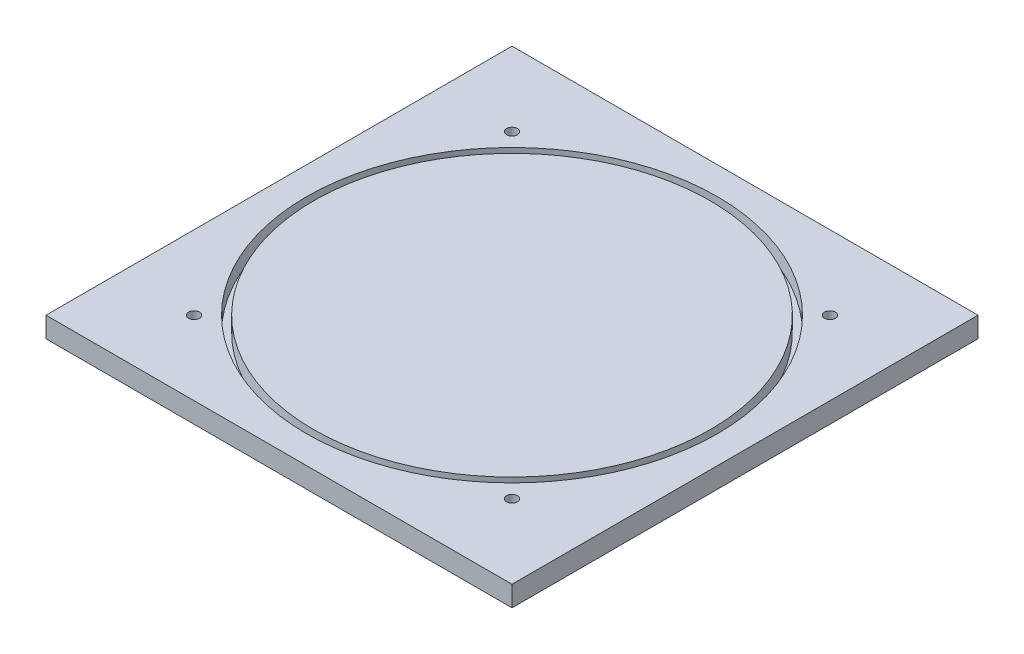
ISO-10303-21;
HEADER;
FILE_DESCRIPTION(('STEP AP214'),'2;1');
FILE_NAME('part.step','',(''),(''),'','','');
FILE_SCHEMA(('AUTOMOTIVE_DESIGN { 1 0 10303 214 1 1 1 1 }'));
ENDSEC;
DATA;
#1=APPLICATION_CONTEXT('core data for automotive mechanical design processes');
#2=APPLICATION_PROTOCOL_DEFINITION('international standard','automotive_design',2000,#1);
#3=PRODUCT_CONTEXT('',#1,'mechanical');
#4=PRODUCT('Part','Part','',(#3));
#5=PRODUCT_RELATED_PRODUCT_CATEGORY('part','',(#4));
#6=PRODUCT_DEFINITION_FORMATION('','',#4);
#7=PRODUCT_DEFINITION_CONTEXT('part definition',#1,'design');
#8=PRODUCT_DEFINITION('design','',#6,#7);
#9=PRODUCT_DEFINITION_SHAPE('','',#8);
#10=(LENGTH_UNIT() NAMED_UNIT(*) SI_UNIT(.MILLI.,.METRE.));
#11=(NAMED_UNIT(*) PLANE_ANGLE_UNIT() SI_UNIT($,.RADIAN.));
#12=(NAMED_UNIT(*) SI_UNIT($,.STERADIAN.) SOLID_ANGLE_UNIT());
#13=UNCERTAINTY_MEASURE_WITH_UNIT(LENGTH_MEASURE(1.E-05),#10,'distance_accuracy_value','');
#14=(GEOMETRIC_REPRESENTATION_CONTEXT(3) GLOBAL_UNCERTAINTY_ASSIGNED_CONTEXT((#13)) GLOBAL_UNIT_ASSIGNED_CONTEXT((#10,
#11,#12)) REPRESENTATION_CONTEXT('',''));
#15=CARTESIAN_POINT('',(0.,0.,0.));
#16=DIRECTION('',(0.,0.,1.));
#17=DIRECTION('',(1.,0.,0.));
#18=AXIS2_PLACEMENT_3D('',#15,#16,#17);
#19=CARTESIAN_POINT('',(0.,0.,0.));
#20=DIRECTION('',(0.,1.,0.));
#21=DIRECTION('',(0.,0.,1.));
#22=AXIS2_PLACEMENT_3D('',#19,#20,#21);
#23=PLANE('',#22);
#24=CARTESIAN_POINT('',(-98.7828173317615,0.,-98.7828173317598));
#25=DIRECTION('',(0.,-1.,0.));
#26=DIRECTION('',(0.,0.,-1.));
#27=AXIS2_PLACEMENT_3D('',#24,#25,#26);
#28=CIRCLE('',#27,3.3782);
#29=CARTESIAN_POINT('',(-98.7828173317615,0.,-102.16101733176));
#30=VERTEX_POINT('',#29);
#31=EDGE_CURVE('E145',#30,#30,#28,.T.);
#32=ORIENTED_EDGE('',*,*,#31,.F.);
#33=EDGE_LOOP('',(#32));
#34=FACE_BOUND('',#33,.T.);
#35=CARTESIAN_POINT('',(98.7828173317608,0.,98.7828173317605));
#36=DIRECTION('',(0.,-1.,0.));
#37=DIRECTION('',(0.,0.,-1.));
#38=AXIS2_PLACEMENT_3D('',#35,#36,#37);
#39=CIRCLE('',#38,3.3782);
#40=CARTESIAN_POINT('',(98.7828173317608,0.,95.4046173317605));
#41=VERTEX_POINT('',#40);
#42=EDGE_CURVE('E133',#41,#41,#39,.T.);
#43=ORIENTED_EDGE('',*,*,#42,.F.);
#44=EDGE_LOOP('',(#43));
#45=FACE_BOUND('',#44,.T.);
#46=CARTESIAN_POINT('',(-98.7828173317609,0.,98.7828173317605));
#47=DIRECTION('',(0.,-1.,0.));
#48=DIRECTION('',(0.,0.,-1.));
#49=AXIS2_PLACEMENT_3D('',#46,#47,#48);
#50=CIRCLE('',#49,3.3782);
#51=CARTESIAN_POINT('',(-98.7828173317609,0.,95.4046173317605));
#52=VERTEX_POINT('',#51);
#53=EDGE_CURVE('E127',#52,#52,#50,.T.);
#54=ORIENTED_EDGE('',*,*,#53,.F.);
#55=EDGE_LOOP('',(#54));
#56=FACE_BOUND('',#55,.T.);
#57=DIRECTION('',(0.,0.,1.));
#58=VECTOR('',#57,1.);
#59=CARTESIAN_POINT('',(-144.78,0.,144.78));
#60=LINE('',#59,#58);
#61=CARTESIAN_POINT('',(-144.78,0.,-144.78));
#62=VERTEX_POINT('',#61);
#63=CARTESIAN_POINT('',(-144.78,0.,144.78));
#64=VERTEX_POINT('',#63);
#65=EDGE_CURVE('E99',#62,#64,#60,.T.);
#66=ORIENTED_EDGE('',*,*,#65,.F.);
#67=DIRECTION('',(-1.,0.,0.));
#68=VECTOR('',#67,1.);
#69=CARTESIAN_POINT('',(144.78,0.,-144.78));
#70=LINE('',#69,#68);
#71=CARTESIAN_POINT('',(144.78,0.,-144.78));
#72=VERTEX_POINT('',#71);
#73=EDGE_CURVE('E75',#72,#62,#70,.T.);
#74=ORIENTED_EDGE('',*,*,#73,.F.);
#75=DIRECTION('',(0.,0.,-1.));
#76=VECTOR('',#75,1.);
#77=CARTESIAN_POINT('',(144.78,0.,144.78));
#78=LINE('',#77,#76);
#79=CARTESIAN_POINT('',(144.78,0.,144.78));
#80=VERTEX_POINT('',#79);
#81=EDGE_CURVE('E69',#80,#72,#78,.T.);
#82=ORIENTED_EDGE('',*,*,#81,.F.);
#83=DIRECTION('',(1.,0.,0.));
#84=VECTOR('',#83,1.);
#85=CARTESIAN_POINT('',(144.78,0.,144.78));
#86=LINE('',#85,#84);
#87=EDGE_CURVE('E91',#64,#80,#86,.T.);
#88=ORIENTED_EDGE('',*,*,#87,.F.);
#89=EDGE_LOOP('',(#66,#74,#82,#88));
#90=FACE_BOUND('',#89,.T.);
#91=CARTESIAN_POINT('',(98.7828173317609,0.,-98.7828173317605));
#92=DIRECTION('',(0.,-1.,0.));
#93=DIRECTION('',(0.,0.,-1.));
#94=AXIS2_PLACEMENT_3D('',#91,#92,#93);
#95=CIRCLE('',#94,3.3782);
#96=CARTESIAN_POINT('',(98.7828173317609,0.,-102.16101733176));
#97=VERTEX_POINT('',#96);
#98=EDGE_CURVE('E139',#97,#97,#95,.T.);
#99=ORIENTED_EDGE('',*,*,#98,.F.);
#100=EDGE_LOOP('',(#99));
#101=FACE_BOUND('',#100,.T.);
#102=ADVANCED_FACE('F35',(#34,#45,#56,#90,#101),#23,.F.);
#103=CARTESIAN_POINT('',(-144.78,12.7,144.78));
#104=DIRECTION('',(1.,0.,0.));
#105=DIRECTION('',(0.,0.,-1.));
#106=AXIS2_PLACEMENT_3D('',#103,#104,#105);
#107=PLANE('',#106);
#108=ORIENTED_EDGE('',*,*,#65,.T.);
#109=DIRECTION('',(0.,-1.,0.));
#110=VECTOR('',#109,1.);
#111=CARTESIAN_POINT('',(-144.78,12.7,144.78));
#112=LINE('',#111,#110);
#113=CARTESIAN_POINT('',(-144.78,12.7,144.78));
#114=VERTEX_POINT('',#113);
#115=EDGE_CURVE('E11',#114,#64,#112,.T.);
#116=ORIENTED_EDGE('',*,*,#115,.F.);
#117=DIRECTION('',(0.,0.,1.));
#118=VECTOR('',#117,1.);
#119=CARTESIAN_POINT('',(-144.78,12.7,144.78));
#120=LINE('',#119,#118);
#121=CARTESIAN_POINT('',(-144.78,12.7,-144.78));
#122=VERTEX_POINT('',#121);
#123=EDGE_CURVE('E87',#122,#114,#120,.T.);
#124=ORIENTED_EDGE('',*,*,#123,.F.);
#125=DIRECTION('',(0.,-1.,0.));
#126=VECTOR('',#125,1.);
#127=CARTESIAN_POINT('',(-144.78,12.7,-144.78));
#128=LINE('',#127,#126);
#129=EDGE_CURVE('E95',#122,#62,#128,.T.);
#130=ORIENTED_EDGE('',*,*,#129,.T.);
#131=EDGE_LOOP('',(#108,#116,#124,#130));
#132=FACE_BOUND('',#131,.T.);
#133=ADVANCED_FACE('F37',(#132),#107,.F.);
#134=CARTESIAN_POINT('',(144.78,12.7,144.78));
#135=DIRECTION('',(0.,0.,-1.));
#136=DIRECTION('',(-1.,0.,0.));
#137=AXIS2_PLACEMENT_3D('',#134,#135,#136);
#138=PLANE('',#137);
#139=ORIENTED_EDGE('',*,*,#87,.T.);
#140=DIRECTION('',(0.,-1.,0.));
#141=VECTOR('',#140,1.);
#142=CARTESIAN_POINT('',(144.78,12.7,144.78));
#143=LINE('',#142,#141);
#144=CARTESIAN_POINT('',(144.78,12.7,144.78));
#145=VERTEX_POINT('',#144);
#146=EDGE_CURVE('E44',#145,#80,#143,.T.);
#147=ORIENTED_EDGE('',*,*,#146,.F.);
#148=DIRECTION('',(1.,0.,0.));
#149=VECTOR('',#148,1.);
#150=CARTESIAN_POINT('',(144.78,12.7,144.78));
#151=LINE('',#150,#149);
#152=EDGE_CURVE('E82',#114,#145,#151,.T.);
#153=ORIENTED_EDGE('',*,*,#152,.F.);
#154=ORIENTED_EDGE('',*,*,#115,.T.);
#155=EDGE_LOOP('',(#139,#147,#153,#154));
#156=FACE_BOUND('',#155,.T.);
#157=ADVANCED_FACE('F90',(#156),#138,.F.);
#158=CARTESIAN_POINT('',(144.78,12.7,144.78));
#159=DIRECTION('',(-1.,0.,0.));
#160=DIRECTION('',(0.,0.,1.));
#161=AXIS2_PLACEMENT_3D('',#158,#159,#160);
#162=PLANE('',#161);
#163=ORIENTED_EDGE('',*,*,#81,.T.);
#164=DIRECTION('',(0.,-1.,0.));
#165=VECTOR('',#164,1.);
#166=CARTESIAN_POINT('',(144.78,12.7,-144.78));
#167=LINE('',#166,#165);
#168=CARTESIAN_POINT('',(144.78,12.7,-144.78));
#169=VERTEX_POINT('',#168);
#170=EDGE_CURVE('E92',#169,#72,#167,.T.);
#171=ORIENTED_EDGE('',*,*,#170,.F.);
#172=DIRECTION('',(0.,0.,-1.));
#173=VECTOR('',#172,1.);
#174=CARTESIAN_POINT('',(144.78,12.7,144.78));
#175=LINE('',#174,#173);
#176=EDGE_CURVE('E85',#145,#169,#175,.T.);
#177=ORIENTED_EDGE('',*,*,#176,.F.);
#178=ORIENTED_EDGE('',*,*,#146,.T.);
#179=EDGE_LOOP('',(#163,#171,#177,#178));
#180=FACE_BOUND('',#179,.T.);
#181=ADVANCED_FACE('F93',(#180),#162,.F.);
#182=CARTESIAN_POINT('',(144.78,12.7,-144.78));
#183=DIRECTION('',(0.,0.,1.));
#184=DIRECTION('',(1.,0.,0.));
#185=AXIS2_PLACEMENT_3D('',#182,#183,#184);
#186=PLANE('',#185);
#187=ORIENTED_EDGE('',*,*,#73,.T.);
#188=ORIENTED_EDGE('',*,*,#129,.F.);
#189=DIRECTION('',(-1.,0.,0.));
#190=VECTOR('',#189,1.);
#191=CARTESIAN_POINT('',(144.78,12.7,-144.78));
#192=LINE('',#191,#190);
#193=EDGE_CURVE('E52',#169,#122,#192,.T.);
#194=ORIENTED_EDGE('',*,*,#193,.F.);
#195=ORIENTED_EDGE('',*,*,#170,.T.);
#196=EDGE_LOOP('',(#187,#188,#194,#195));
#197=FACE_BOUND('',#196,.T.);
#198=ADVANCED_FACE('F107',(#197),#186,.F.);
#199=CARTESIAN_POINT('',(0.,12.7,0.));
#200=DIRECTION('',(0.,1.,0.));
#201=DIRECTION('',(0.,0.,1.));
#202=AXIS2_PLACEMENT_3D('',#199,#200,#201);
#203=PLANE('',#202);
#204=CARTESIAN_POINT('',(-98.7828173317615,12.7,-98.7828173317598));
#205=DIRECTION('',(0.,-1.,0.));
#206=DIRECTION('',(0.,0.,-1.));
#207=AXIS2_PLACEMENT_3D('',#204,#205,#206);
#208=CIRCLE('',#207,3.3782);
#209=CARTESIAN_POINT('',(-98.7828173317615,12.7,-102.16101733176));
#210=VERTEX_POINT('',#209);
#211=EDGE_CURVE('E142',#210,#210,#208,.T.);
#212=ORIENTED_EDGE('',*,*,#211,.T.);
#213=EDGE_LOOP('',(#212));
#214=FACE_BOUND('',#213,.T.);
#215=CARTESIAN_POINT('',(98.7828173317609,12.7,-98.7828173317605));
#216=DIRECTION('',(0.,-1.,0.));
#217=DIRECTION('',(0.,0.,-1.));
#218=AXIS2_PLACEMENT_3D('',#215,#216,#217);
#219=CIRCLE('',#218,3.3782);
#220=CARTESIAN_POINT('',(98.7828173317609,12.7,-102.16101733176));
#221=VERTEX_POINT('',#220);
#222=EDGE_CURVE('E136',#221,#221,#219,.T.);
#223=ORIENTED_EDGE('',*,*,#222,.T.);
#224=EDGE_LOOP('',(#223));
#225=FACE_BOUND('',#224,.T.);
#226=CARTESIAN_POINT('',(98.7828173317608,12.7,98.7828173317605));
#227=DIRECTION('',(0.,-1.,0.));
#228=DIRECTION('',(0.,0.,-1.));
#229=AXIS2_PLACEMENT_3D('',#226,#227,#228);
#230=CIRCLE('',#229,3.3782);
#231=CARTESIAN_POINT('',(98.7828173317608,12.7,95.4046173317605));
#232=VERTEX_POINT('',#231);
#233=EDGE_CURVE('E130',#232,#232,#230,.T.);
#234=ORIENTED_EDGE('',*,*,#233,.T.);
#235=EDGE_LOOP('',(#234));
#236=FACE_BOUND('',#235,.T.);
#237=CARTESIAN_POINT('',(-98.7828173317609,12.7,98.7828173317605));
#238=DIRECTION('',(0.,-1.,0.));
#239=DIRECTION('',(0.,0.,-1.));
#240=AXIS2_PLACEMENT_3D('',#237,#238,#239);
#241=CIRCLE('',#240,3.3782);
#242=CARTESIAN_POINT('',(-98.7828173317609,12.7,95.4046173317605));
#243=VERTEX_POINT('',#242);
#244=EDGE_CURVE('E122',#243,#243,#241,.T.);
#245=ORIENTED_EDGE('',*,*,#244,.T.);
#246=EDGE_LOOP('',(#245));
#247=FACE_BOUND('',#246,.T.);
#248=CARTESIAN_POINT('',(0.,12.7,0.));
#249=DIRECTION('',(0.,1.,0.));
#250=DIRECTION('',(0.,0.,1.));
#251=AXIS2_PLACEMENT_3D('',#248,#249,#250);
#252=CIRCLE('',#251,127.635);
#253=CARTESIAN_POINT('',(0.,12.7,127.635));
#254=VERTEX_POINT('',#253);
#255=EDGE_CURVE('E113',#254,#254,#252,.T.);
#256=ORIENTED_EDGE('',*,*,#255,.F.);
#257=EDGE_LOOP('',(#256));
#258=FACE_BOUND('',#257,.T.);
#259=ORIENTED_EDGE('',*,*,#123,.T.);
#260=ORIENTED_EDGE('',*,*,#152,.T.);
#261=ORIENTED_EDGE('',*,*,#176,.T.);
#262=ORIENTED_EDGE('',*,*,#193,.T.);
#263=EDGE_LOOP('',(#259,#260,#261,#262));
#264=FACE_BOUND('',#263,.T.);
#265=ADVANCED_FACE('F83',(#214,#225,#236,#247,#258,#264),#203,.T.);
#266=CARTESIAN_POINT('',(0.,3.175,0.));
#267=DIRECTION('',(0.,1.,0.));
#268=DIRECTION('',(0.,0.,1.));
#269=AXIS2_PLACEMENT_3D('',#266,#267,#268);
#270=CYLINDRICAL_SURFACE('',#269,127.635);
#271=CARTESIAN_POINT('',(0.,3.175,0.));
#272=DIRECTION('',(0.,1.,0.));
#273=DIRECTION('',(0.,0.,1.));
#274=AXIS2_PLACEMENT_3D('',#271,#272,#273);
#275=CIRCLE('',#274,127.635);
#276=CARTESIAN_POINT('',(0.,3.175,127.635));
#277=VERTEX_POINT('',#276);
#278=EDGE_CURVE('E102',#277,#277,#275,.T.);
#279=ORIENTED_EDGE('',*,*,#278,.F.);
#280=EDGE_LOOP('',(#279));
#281=FACE_BOUND('',#280,.T.);
#282=ORIENTED_EDGE('',*,*,#255,.T.);
#283=EDGE_LOOP('',(#282));
#284=FACE_BOUND('',#283,.T.);
#285=ADVANCED_FACE('F183',(#281,#284),#270,.F.);
#286=CARTESIAN_POINT('',(0.,3.175,0.));
#287=DIRECTION('',(0.,1.,0.));
#288=DIRECTION('',(0.,0.,1.));
#289=AXIS2_PLACEMENT_3D('',#286,#287,#288);
#290=PLANE('',#289);
#291=CARTESIAN_POINT('',(0.,3.175,0.));
#292=DIRECTION('',(0.,1.,0.));
#293=DIRECTION('',(0.,0.,1.));
#294=AXIS2_PLACEMENT_3D('',#291,#292,#293);
#295=CIRCLE('',#294,123.19);
#296=CARTESIAN_POINT('',(0.,3.175,123.19));
#297=VERTEX_POINT('',#296);
#298=EDGE_CURVE('E116',#297,#297,#295,.T.);
#299=ORIENTED_EDGE('',*,*,#298,.F.);
#300=EDGE_LOOP('',(#299));
#301=FACE_BOUND('',#300,.T.);
#302=ORIENTED_EDGE('',*,*,#278,.T.);
#303=EDGE_LOOP('',(#302));
#304=FACE_BOUND('',#303,.T.);
#305=ADVANCED_FACE('F179',(#301,#304),#290,.T.);
#306=CARTESIAN_POINT('',(0.,3.175,0.));
#307=DIRECTION('',(0.,1.,0.));
#308=DIRECTION('',(0.,0.,1.));
#309=AXIS2_PLACEMENT_3D('',#306,#307,#308);
#310=CYLINDRICAL_SURFACE('',#309,123.19);
#311=ORIENTED_EDGE('',*,*,#298,.T.);
#312=EDGE_LOOP('',(#311));
#313=FACE_BOUND('',#312,.T.);
#314=CARTESIAN_POINT('',(0.,12.7,0.));
#315=DIRECTION('',(0.,1.,0.));
#316=DIRECTION('',(0.,0.,1.));
#317=AXIS2_PLACEMENT_3D('',#314,#315,#316);
#318=CIRCLE('',#317,123.19);
#319=CARTESIAN_POINT('',(0.,12.7,123.19));
#320=VERTEX_POINT('',#319);
#321=EDGE_CURVE('E119',#320,#320,#318,.T.);
#322=ORIENTED_EDGE('',*,*,#321,.F.);
#323=EDGE_LOOP('',(#322));
#324=FACE_BOUND('',#323,.T.);
#325=ADVANCED_FACE('F171',(#313,#324),#310,.T.);
#326=ORIENTED_EDGE('',*,*,#321,.T.);
#327=EDGE_LOOP('',(#326));
#328=FACE_BOUND('',#327,.T.);
#329=ADVANCED_FACE('F161',(#328),#203,.T.);
#330=CARTESIAN_POINT('',(-98.7828173317609,0.,98.7828173317605));
#331=DIRECTION('',(0.,-1.,0.));
#332=DIRECTION('',(0.,0.,-1.));
#333=AXIS2_PLACEMENT_3D('',#330,#331,#332);
#334=CYLINDRICAL_SURFACE('',#333,3.3782);
#335=ORIENTED_EDGE('',*,*,#244,.F.);
#336=EDGE_LOOP('',(#335));
#337=FACE_BOUND('',#336,.T.);
#338=ORIENTED_EDGE('',*,*,#53,.T.);
#339=EDGE_LOOP('',(#338));
#340=FACE_BOUND('',#339,.T.);
#341=ADVANCED_FACE('F158',(#337,#340),#334,.F.);
#342=CARTESIAN_POINT('',(98.7828173317608,0.,98.7828173317605));
#343=DIRECTION('',(0.,-1.,0.));
#344=DIRECTION('',(0.,0.,-1.));
#345=AXIS2_PLACEMENT_3D('',#342,#343,#344);
#346=CYLINDRICAL_SURFACE('',#345,3.3782);
#347=ORIENTED_EDGE('',*,*,#233,.F.);
#348=EDGE_LOOP('',(#347));
#349=FACE_BOUND('',#348,.T.);
#350=ORIENTED_EDGE('',*,*,#42,.T.);
#351=EDGE_LOOP('',(#350));
#352=FACE_BOUND('',#351,.T.);
#353=ADVANCED_FACE('F160',(#349,#352),#346,.F.);
#354=CARTESIAN_POINT('',(98.7828173317609,0.,-98.7828173317605));
#355=DIRECTION('',(0.,-1.,0.));
#356=DIRECTION('',(0.,0.,-1.));
#357=AXIS2_PLACEMENT_3D('',#354,#355,#356);
#358=CYLINDRICAL_SURFACE('',#357,3.3782);
#359=ORIENTED_EDGE('',*,*,#222,.F.);
#360=EDGE_LOOP('',(#359));
#361=FACE_BOUND('',#360,.T.);
#362=ORIENTED_EDGE('',*,*,#98,.T.);
#363=EDGE_LOOP('',(#362));
#364=FACE_BOUND('',#363,.T.);
#365=ADVANCED_FACE('F168',(#361,#364),#358,.F.);
#366=CARTESIAN_POINT('',(-98.7828173317615,0.,-98.7828173317598));
#367=DIRECTION('',(0.,-1.,0.));
#368=DIRECTION('',(0.,0.,-1.));
#369=AXIS2_PLACEMENT_3D('',#366,#367,#368);
#370=CYLINDRICAL_SURFACE('',#369,3.3782);
#371=ORIENTED_EDGE('',*,*,#211,.F.);
#372=EDGE_LOOP('',(#371));
#373=FACE_BOUND('',#372,.T.);
#374=ORIENTED_EDGE('',*,*,#31,.T.);
#375=EDGE_LOOP('',(#374));
#376=FACE_BOUND('',#375,.T.);
#377=ADVANCED_FACE('F149',(#373,#376),#370,.F.);
#378=CLOSED_SHELL('',(#102,#133,#157,#181,#198,#265,#285,#305,#325,#329,#341,#353,#365,#377));
#379=MANIFOLD_SOLID_BREP('B2',#378);
#380=ADVANCED_BREP_SHAPE_REPRESENTATION('',(#18,#379),#14);
#381=SHAPE_DEFINITION_REPRESENTATION(#9,#380);
ENDSEC;
END-ISO-10303-21;
